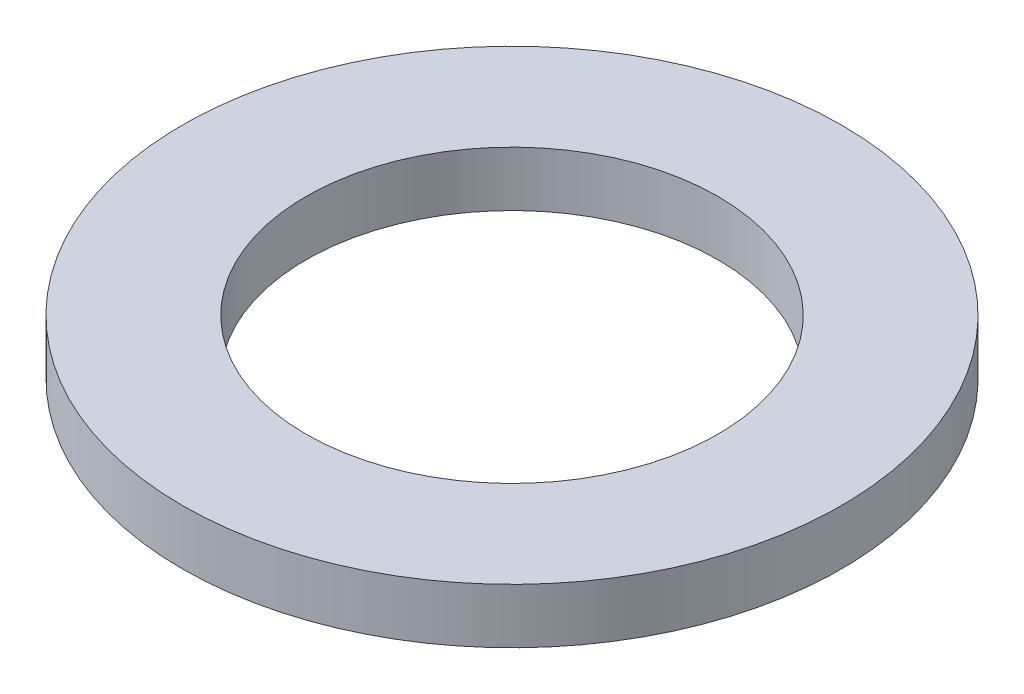
ISO-10303-21;
HEADER;
FILE_DESCRIPTION(('STEP AP214'),'2;1');
FILE_NAME('part.step','',(''),(''),'','','');
FILE_SCHEMA(('AUTOMOTIVE_DESIGN { 1 0 10303 214 1 1 1 1 }'));
ENDSEC;
DATA;
#1=APPLICATION_CONTEXT('core data for automotive mechanical design processes');
#2=APPLICATION_PROTOCOL_DEFINITION('international standard','automotive_design',2000,#1);
#3=PRODUCT_CONTEXT('',#1,'mechanical');
#4=PRODUCT('Part','Part','',(#3));
#5=PRODUCT_RELATED_PRODUCT_CATEGORY('part','',(#4));
#6=PRODUCT_DEFINITION_FORMATION('','',#4);
#7=PRODUCT_DEFINITION_CONTEXT('part definition',#1,'design');
#8=PRODUCT_DEFINITION('design','',#6,#7);
#9=PRODUCT_DEFINITION_SHAPE('','',#8);
#10=(LENGTH_UNIT() NAMED_UNIT(*) SI_UNIT(.MILLI.,.METRE.));
#11=(NAMED_UNIT(*) PLANE_ANGLE_UNIT() SI_UNIT($,.RADIAN.));
#12=(NAMED_UNIT(*) SI_UNIT($,.STERADIAN.) SOLID_ANGLE_UNIT());
#13=UNCERTAINTY_MEASURE_WITH_UNIT(LENGTH_MEASURE(1.E-05),#10,'distance_accuracy_value','');
#14=(GEOMETRIC_REPRESENTATION_CONTEXT(3) GLOBAL_UNCERTAINTY_ASSIGNED_CONTEXT((#13)) GLOBAL_UNIT_ASSIGNED_CONTEXT((#10,
#11,#12)) REPRESENTATION_CONTEXT('',''));
#15=CARTESIAN_POINT('',(0.,0.,0.));
#16=DIRECTION('',(0.,0.,1.));
#17=DIRECTION('',(1.,0.,0.));
#18=AXIS2_PLACEMENT_3D('',#15,#16,#17);
#19=CARTESIAN_POINT('',(0.,10.,0.));
#20=DIRECTION('',(0.,-1.,0.));
#21=DIRECTION('',(0.,0.,-1.));
#22=AXIS2_PLACEMENT_3D('',#19,#20,#21);
#23=CYLINDRICAL_SURFACE('',#22,60.);
#24=CARTESIAN_POINT('',(0.,10.,0.));
#25=DIRECTION('',(0.,1.,0.));
#26=DIRECTION('',(0.,0.,1.));
#27=AXIS2_PLACEMENT_3D('',#24,#25,#26);
#28=CIRCLE('',#27,60.);
#29=CARTESIAN_POINT('',(0.,10.,60.));
#30=VERTEX_POINT('',#29);
#31=EDGE_CURVE('E10',#30,#30,#28,.T.);
#32=ORIENTED_EDGE('',*,*,#31,.F.);
#33=EDGE_LOOP('',(#32));
#34=FACE_BOUND('',#33,.T.);
#35=CARTESIAN_POINT('',(0.,0.,0.));
#36=DIRECTION('',(0.,1.,0.));
#37=DIRECTION('',(0.,0.,1.));
#38=AXIS2_PLACEMENT_3D('',#35,#36,#37);
#39=CIRCLE('',#38,60.);
#40=CARTESIAN_POINT('',(0.,0.,60.));
#41=VERTEX_POINT('',#40);
#42=EDGE_CURVE('E37',#41,#41,#39,.T.);
#43=ORIENTED_EDGE('',*,*,#42,.T.);
#44=EDGE_LOOP('',(#43));
#45=FACE_BOUND('',#44,.T.);
#46=ADVANCED_FACE('F40',(#34,#45),#23,.T.);
#47=CARTESIAN_POINT('',(0.,10.,0.));
#48=DIRECTION('',(0.,1.,0.));
#49=DIRECTION('',(0.,0.,1.));
#50=AXIS2_PLACEMENT_3D('',#47,#48,#49);
#51=PLANE('',#50);
#52=CARTESIAN_POINT('',(0.,10.,0.));
#53=DIRECTION('',(0.,1.,0.));
#54=DIRECTION('',(0.,0.,1.));
#55=AXIS2_PLACEMENT_3D('',#52,#53,#54);
#56=CIRCLE('',#55,37.5);
#57=CARTESIAN_POINT('',(0.,10.,37.5));
#58=VERTEX_POINT('',#57);
#59=EDGE_CURVE('E50',#58,#58,#56,.T.);
#60=ORIENTED_EDGE('',*,*,#59,.F.);
#61=EDGE_LOOP('',(#60));
#62=FACE_BOUND('',#61,.T.);
#63=ORIENTED_EDGE('',*,*,#31,.T.);
#64=EDGE_LOOP('',(#63));
#65=FACE_BOUND('',#64,.T.);
#66=ADVANCED_FACE('F59',(#62,#65),#51,.T.);
#67=CARTESIAN_POINT('',(0.,0.,0.));
#68=DIRECTION('',(0.,1.,0.));
#69=DIRECTION('',(0.,0.,1.));
#70=AXIS2_PLACEMENT_3D('',#67,#68,#69);
#71=PLANE('',#70);
#72=CARTESIAN_POINT('',(0.,0.,0.));
#73=DIRECTION('',(0.,1.,0.));
#74=DIRECTION('',(0.,0.,1.));
#75=AXIS2_PLACEMENT_3D('',#72,#73,#74);
#76=CIRCLE('',#75,37.5);
#77=CARTESIAN_POINT('',(0.,0.,37.5));
#78=VERTEX_POINT('',#77);
#79=EDGE_CURVE('E47',#78,#78,#76,.T.);
#80=ORIENTED_EDGE('',*,*,#79,.T.);
#81=EDGE_LOOP('',(#80));
#82=FACE_BOUND('',#81,.T.);
#83=ORIENTED_EDGE('',*,*,#42,.F.);
#84=EDGE_LOOP('',(#83));
#85=FACE_BOUND('',#84,.T.);
#86=ADVANCED_FACE('F58',(#82,#85),#71,.F.);
#87=CARTESIAN_POINT('',(0.,10.,0.));
#88=DIRECTION('',(0.,-1.,0.));
#89=DIRECTION('',(0.,0.,-1.));
#90=AXIS2_PLACEMENT_3D('',#87,#88,#89);
#91=CYLINDRICAL_SURFACE('',#90,37.5);
#92=ORIENTED_EDGE('',*,*,#59,.T.);
#93=EDGE_LOOP('',(#92));
#94=FACE_BOUND('',#93,.T.);
#95=ORIENTED_EDGE('',*,*,#79,.F.);
#96=EDGE_LOOP('',(#95));
#97=FACE_BOUND('',#96,.T.);
#98=ADVANCED_FACE('F54',(#94,#97),#91,.F.);
#99=CLOSED_SHELL('',(#46,#66,#86,#98));
#100=MANIFOLD_SOLID_BREP('B2',#99);
#101=ADVANCED_BREP_SHAPE_REPRESENTATION('',(#18,#100),#14);
#102=SHAPE_DEFINITION_REPRESENTATION(#9,#101);
ENDSEC;
END-ISO-10303-21;
